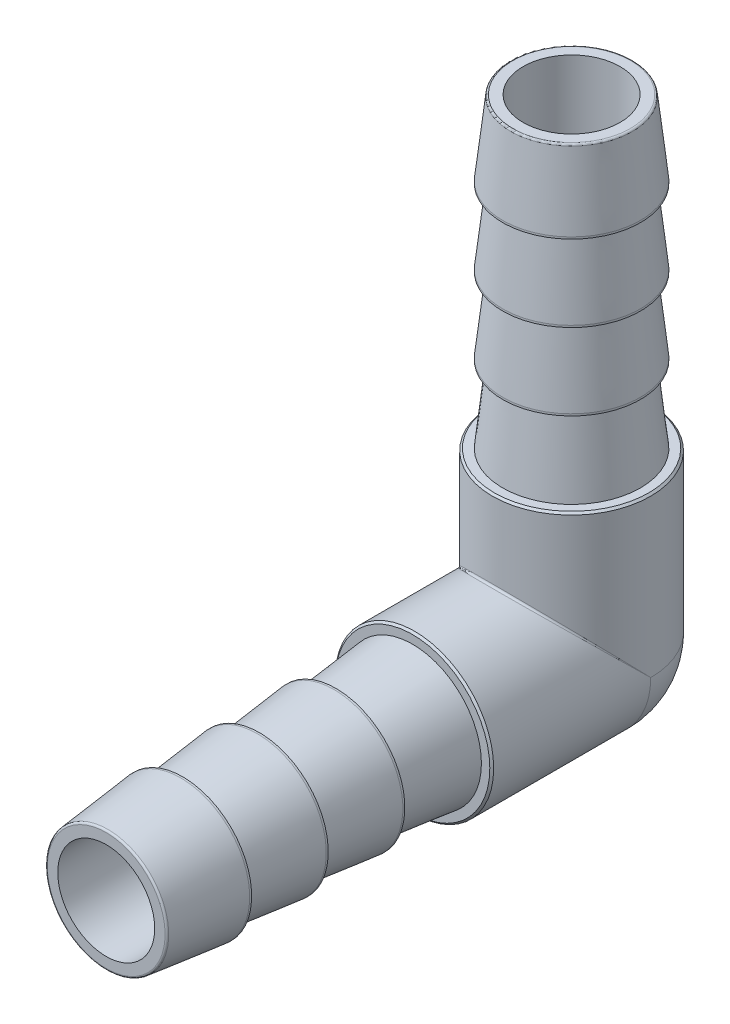
ISO-10303-21;
HEADER;
FILE_DESCRIPTION(('STEP AP214'),'2;1');
FILE_NAME('part.step','',(''),(''),'','','');
FILE_SCHEMA(('AUTOMOTIVE_DESIGN { 1 0 10303 214 1 1 1 1 }'));
ENDSEC;
DATA;
#1=APPLICATION_CONTEXT('core data for automotive mechanical design processes');
#2=APPLICATION_PROTOCOL_DEFINITION('international standard','automotive_design',2000,#1);
#3=PRODUCT_CONTEXT('',#1,'mechanical');
#4=PRODUCT('Part','Part','',(#3));
#5=PRODUCT_RELATED_PRODUCT_CATEGORY('part','',(#4));
#6=PRODUCT_DEFINITION_FORMATION('','',#4);
#7=PRODUCT_DEFINITION_CONTEXT('part definition',#1,'design');
#8=PRODUCT_DEFINITION('design','',#6,#7);
#9=PRODUCT_DEFINITION_SHAPE('','',#8);
#10=(LENGTH_UNIT() NAMED_UNIT(*) SI_UNIT(.MILLI.,.METRE.));
#11=(NAMED_UNIT(*) PLANE_ANGLE_UNIT() SI_UNIT($,.RADIAN.));
#12=(NAMED_UNIT(*) SI_UNIT($,.STERADIAN.) SOLID_ANGLE_UNIT());
#13=UNCERTAINTY_MEASURE_WITH_UNIT(LENGTH_MEASURE(1.E-05),#10,'distance_accuracy_value','');
#14=(GEOMETRIC_REPRESENTATION_CONTEXT(3) GLOBAL_UNCERTAINTY_ASSIGNED_CONTEXT((#13)) GLOBAL_UNIT_ASSIGNED_CONTEXT((#10,
#11,#12)) REPRESENTATION_CONTEXT('',''));
#15=CARTESIAN_POINT('',(0.,0.,0.));
#16=DIRECTION('',(0.,0.,1.));
#17=DIRECTION('',(1.,0.,0.));
#18=AXIS2_PLACEMENT_3D('',#15,#16,#17);
#19=CARTESIAN_POINT('',(0.,30.48,-1.06420351207939E-13));
#20=DIRECTION('',(0.,-1.,0.));
#21=DIRECTION('',(-1.,0.,0.));
#22=AXIS2_PLACEMENT_3D('',#19,#20,#21);
#23=PLANE('',#22);
#24=CARTESIAN_POINT('',(0.,30.48,-1.06420351207939E-13));
#25=DIRECTION('',(0.,-1.,0.));
#26=DIRECTION('',(0.,0.,-1.));
#27=AXIS2_PLACEMENT_3D('',#24,#25,#26);
#28=CIRCLE('',#27,3.85499802113188);
#29=CARTESIAN_POINT('',(0.,30.48,-3.85499802113199));
#30=VERTEX_POINT('',#29);
#31=EDGE_CURVE('E200',#30,#30,#28,.F.);
#32=ORIENTED_EDGE('',*,*,#31,.T.);
#33=EDGE_LOOP('',(#32));
#34=FACE_BOUND('',#33,.T.);
#35=CARTESIAN_POINT('',(0.,30.48,-1.06420351207939E-13));
#36=DIRECTION('',(0.,1.,0.));
#37=DIRECTION('',(1.,0.,0.));
#38=AXIS2_PLACEMENT_3D('',#35,#36,#37);
#39=CIRCLE('',#38,3.175);
#40=CARTESIAN_POINT('',(3.175,30.48,-1.06420351207939E-13));
#41=VERTEX_POINT('',#40);
#42=EDGE_CURVE('E85',#41,#41,#39,.T.);
#43=ORIENTED_EDGE('',*,*,#42,.F.);
#44=EDGE_LOOP('',(#43));
#45=FACE_BOUND('',#44,.T.);
#46=ADVANCED_FACE('F41',(#34,#45),#23,.F.);
#47=CARTESIAN_POINT('',(0.,0.,30.48));
#48=DIRECTION('',(0.,0.,1.));
#49=DIRECTION('',(1.,0.,0.));
#50=AXIS2_PLACEMENT_3D('',#47,#48,#49);
#51=CYLINDRICAL_SURFACE('',#50,3.175);
#52=CARTESIAN_POINT('',(0.,0.,30.48));
#53=DIRECTION('',(0.,0.,1.));
#54=DIRECTION('',(1.,0.,0.));
#55=AXIS2_PLACEMENT_3D('',#52,#53,#54);
#56=CIRCLE('',#55,3.175);
#57=CARTESIAN_POINT('',(3.175,0.,30.48));
#58=VERTEX_POINT('',#57);
#59=EDGE_CURVE('E84',#58,#58,#56,.T.);
#60=ORIENTED_EDGE('',*,*,#59,.T.);
#61=EDGE_LOOP('',(#60));
#62=FACE_BOUND('',#61,.T.);
#63=CARTESIAN_POINT('',(0.,0.,0.));
#64=DIRECTION('',(0.,0.,1.));
#65=DIRECTION('',(1.,0.,0.));
#66=AXIS2_PLACEMENT_3D('',#63,#64,#65);
#67=CIRCLE('',#66,3.175);
#68=CARTESIAN_POINT('',(-3.175,0.,0.));
#69=VERTEX_POINT('',#68);
#70=CARTESIAN_POINT('',(3.175,0.,0.));
#71=VERTEX_POINT('',#70);
#72=EDGE_CURVE('E82',#69,#71,#67,.T.);
#73=ORIENTED_EDGE('',*,*,#72,.F.);
#74=CARTESIAN_POINT('',(0.,0.,0.));
#75=DIRECTION('',(0.,-0.707106781186546,0.707106781186549));
#76=DIRECTION('',(0.,0.707106781186549,0.707106781186546));
#77=AXIS2_PLACEMENT_3D('',#74,#75,#76);
#78=ELLIPSE('',#77,4.49012806053457,3.175);
#79=EDGE_CURVE('E71',#69,#71,#78,.F.);
#80=ORIENTED_EDGE('',*,*,#79,.T.);
#81=EDGE_LOOP('',(#73,#80));
#82=FACE_BOUND('',#81,.T.);
#83=ADVANCED_FACE('F87',(#62,#82),#51,.F.);
#84=CARTESIAN_POINT('',(0.,0.,30.48));
#85=DIRECTION('',(0.,0.,-1.));
#86=DIRECTION('',(-1.,0.,0.));
#87=AXIS2_PLACEMENT_3D('',#84,#85,#86);
#88=PLANE('',#87);
#89=CARTESIAN_POINT('',(0.,0.,30.48));
#90=DIRECTION('',(0.,0.,-1.));
#91=DIRECTION('',(-1.,0.,0.));
#92=AXIS2_PLACEMENT_3D('',#89,#90,#91);
#93=CIRCLE('',#92,3.85499802113188);
#94=CARTESIAN_POINT('',(-3.85499802113188,0.,30.48));
#95=VERTEX_POINT('',#94);
#96=EDGE_CURVE('E208',#95,#95,#93,.F.);
#97=ORIENTED_EDGE('',*,*,#96,.T.);
#98=EDGE_LOOP('',(#97));
#99=FACE_BOUND('',#98,.T.);
#100=ORIENTED_EDGE('',*,*,#59,.F.);
#101=EDGE_LOOP('',(#100));
#102=FACE_BOUND('',#101,.T.);
#103=ADVANCED_FACE('F245',(#99,#102),#88,.F.);
#104=CARTESIAN_POINT('',(0.,30.48,-1.06420351207939E-13));
#105=DIRECTION('',(0.,1.,0.));
#106=DIRECTION('',(1.,0.,0.));
#107=AXIS2_PLACEMENT_3D('',#104,#105,#106);
#108=CYLINDRICAL_SURFACE('',#107,5.184775);
#109=CARTESIAN_POINT('',(0.,10.287,0.));
#110=DIRECTION('',(0.,1.,0.));
#111=DIRECTION('',(0.,0.,1.));
#112=AXIS2_PLACEMENT_3D('',#109,#110,#111);
#113=CIRCLE('',#112,5.184775);
#114=CARTESIAN_POINT('',(0.,10.287,5.18477499999996));
#115=VERTEX_POINT('',#114);
#116=EDGE_CURVE('E78',#115,#115,#113,.F.);
#117=ORIENTED_EDGE('',*,*,#116,.T.);
#118=EDGE_LOOP('',(#117));
#119=FACE_BOUND('',#118,.T.);
#120=CARTESIAN_POINT('',(0.,0.,0.));
#121=DIRECTION('',(0.,1.,0.));
#122=DIRECTION('',(1.,0.,0.));
#123=AXIS2_PLACEMENT_3D('',#120,#121,#122);
#124=CIRCLE('',#123,5.184775);
#125=CARTESIAN_POINT('',(5.184775,0.,0.));
#126=VERTEX_POINT('',#125);
#127=CARTESIAN_POINT('',(-5.184775,0.,0.));
#128=VERTEX_POINT('',#127);
#129=EDGE_CURVE('E135',#126,#128,#124,.T.);
#130=ORIENTED_EDGE('',*,*,#129,.T.);
#131=CARTESIAN_POINT('',(0.,0.,0.));
#132=DIRECTION('',(0.,-0.698500220046649,0.71560983964363));
#133=DIRECTION('',(0.,0.71560983964363,0.698500220046649));
#134=AXIS2_PLACEMENT_3D('',#131,#132,#133);
#135=ELLIPSE('',#134,7.4227249343654,5.184775);
#136=EDGE_CURVE('E55',#128,#126,#135,.F.);
#137=ORIENTED_EDGE('',*,*,#136,.T.);
#138=EDGE_LOOP('',(#130,#137));
#139=FACE_BOUND('',#138,.T.);
#140=ADVANCED_FACE('F217',(#119,#139),#108,.T.);
#141=CARTESIAN_POINT('',(0.,0.,30.48));
#142=DIRECTION('',(0.,0.,1.));
#143=DIRECTION('',(1.,0.,0.));
#144=AXIS2_PLACEMENT_3D('',#141,#142,#143);
#145=CYLINDRICAL_SURFACE('',#144,5.184775);
#146=CARTESIAN_POINT('',(0.,0.,10.287));
#147=DIRECTION('',(0.,0.,1.));
#148=DIRECTION('',(1.,0.,0.));
#149=AXIS2_PLACEMENT_3D('',#146,#147,#148);
#150=CIRCLE('',#149,5.184775);
#151=CARTESIAN_POINT('',(5.184775,0.,10.287));
#152=VERTEX_POINT('',#151);
#153=EDGE_CURVE('E186',#152,#152,#150,.F.);
#154=ORIENTED_EDGE('',*,*,#153,.T.);
#155=EDGE_LOOP('',(#154));
#156=FACE_BOUND('',#155,.T.);
#157=CARTESIAN_POINT('',(0.,0.,0.));
#158=DIRECTION('',(0.,0.,1.));
#159=DIRECTION('',(1.,0.,0.));
#160=AXIS2_PLACEMENT_3D('',#157,#158,#159);
#161=CIRCLE('',#160,5.184775);
#162=EDGE_CURVE('E179',#128,#126,#161,.T.);
#163=ORIENTED_EDGE('',*,*,#162,.T.);
#164=CARTESIAN_POINT('',(0.,0.,0.));
#165=DIRECTION('',(0.,-0.715609839643628,0.698500220046652));
#166=DIRECTION('',(0.,0.698500220046652,0.715609839643628));
#167=AXIS2_PLACEMENT_3D('',#164,#165,#166);
#168=ELLIPSE('',#167,7.4227249343654,5.184775);
#169=EDGE_CURVE('E11',#126,#128,#168,.T.);
#170=ORIENTED_EDGE('',*,*,#169,.T.);
#171=EDGE_LOOP('',(#163,#170));
#172=FACE_BOUND('',#171,.T.);
#173=ADVANCED_FACE('F220',(#156,#172),#145,.T.);
#174=CARTESIAN_POINT('',(0.,0.,20.574));
#175=DIRECTION('',(0.,0.,-1.));
#176=DIRECTION('',(-1.,0.,0.));
#177=AXIS2_PLACEMENT_3D('',#174,#175,#176);
#178=CONICAL_SURFACE('',#177,4.5085,0.109944462919684);
#179=CARTESIAN_POINT('',(0.,0.,25.4635));
#180=DIRECTION('',(0.,0.,-1.));
#181=DIRECTION('',(-1.,0.,0.));
#182=AXIS2_PLACEMENT_3D('',#179,#180,#181);
#183=CIRCLE('',#182,3.96875);
#184=CARTESIAN_POINT('',(-3.96875,0.,25.4635));
#185=VERTEX_POINT('',#184);
#186=EDGE_CURVE('E151',#185,#185,#183,.T.);
#187=ORIENTED_EDGE('',*,*,#186,.T.);
#188=EDGE_LOOP('',(#187));
#189=FACE_BOUND('',#188,.T.);
#190=CARTESIAN_POINT('',(0.,0.,20.574));
#191=DIRECTION('',(0.,0.,-1.));
#192=DIRECTION('',(-1.,0.,0.));
#193=AXIS2_PLACEMENT_3D('',#190,#191,#192);
#194=CIRCLE('',#193,4.5085);
#195=CARTESIAN_POINT('',(-4.5085,0.,20.574));
#196=VERTEX_POINT('',#195);
#197=EDGE_CURVE('E159',#196,#196,#194,.T.);
#198=ORIENTED_EDGE('',*,*,#197,.F.);
#199=EDGE_LOOP('',(#198));
#200=FACE_BOUND('',#199,.T.);
#201=ADVANCED_FACE('F272',(#189,#200),#178,.T.);
#202=CARTESIAN_POINT('',(0.,0.,5.3975));
#203=DIRECTION('',(0.,0.,-1.));
#204=DIRECTION('',(-1.,0.,0.));
#205=AXIS2_PLACEMENT_3D('',#202,#203,#204);
#206=CYLINDRICAL_SURFACE('',#205,4.5085);
#207=ORIENTED_EDGE('',*,*,#197,.T.);
#208=EDGE_LOOP('',(#207));
#209=FACE_BOUND('',#208,.T.);
#210=CARTESIAN_POINT('',(0.,0.,20.447));
#211=DIRECTION('',(0.,0.,-1.));
#212=DIRECTION('',(-1.,0.,0.));
#213=AXIS2_PLACEMENT_3D('',#210,#211,#212);
#214=CIRCLE('',#213,4.5085);
#215=CARTESIAN_POINT('',(-4.5085,0.,20.447));
#216=VERTEX_POINT('',#215);
#217=EDGE_CURVE('E155',#216,#216,#214,.T.);
#218=ORIENTED_EDGE('',*,*,#217,.F.);
#219=EDGE_LOOP('',(#218));
#220=FACE_BOUND('',#219,.T.);
#221=ADVANCED_FACE('F268',(#209,#220),#206,.T.);
#222=CARTESIAN_POINT('',(0.,3.96875,20.447));
#223=DIRECTION('',(0.,0.,-1.));
#224=DIRECTION('',(-1.,0.,0.));
#225=AXIS2_PLACEMENT_3D('',#222,#223,#224);
#226=PLANE('',#225);
#227=ORIENTED_EDGE('',*,*,#217,.T.);
#228=EDGE_LOOP('',(#227));
#229=FACE_BOUND('',#228,.T.);
#230=CARTESIAN_POINT('',(0.,0.,20.447));
#231=DIRECTION('',(0.,0.,-1.));
#232=DIRECTION('',(-1.,0.,0.));
#233=AXIS2_PLACEMENT_3D('',#230,#231,#232);
#234=CIRCLE('',#233,3.96875);
#235=CARTESIAN_POINT('',(-3.96875,0.,20.447));
#236=VERTEX_POINT('',#235);
#237=EDGE_CURVE('E139',#236,#236,#234,.T.);
#238=ORIENTED_EDGE('',*,*,#237,.F.);
#239=EDGE_LOOP('',(#238));
#240=FACE_BOUND('',#239,.T.);
#241=ADVANCED_FACE('F264',(#229,#240),#226,.T.);
#242=CARTESIAN_POINT('',(0.,0.,25.5905));
#243=DIRECTION('',(0.,0.,-1.));
#244=DIRECTION('',(-1.,0.,0.));
#245=AXIS2_PLACEMENT_3D('',#242,#243,#244);
#246=CONICAL_SURFACE('',#245,4.5085,0.109944462919684);
#247=CARTESIAN_POINT('',(0.,0.,30.3669348336045));
#248=DIRECTION('',(0.,0.,-1.));
#249=DIRECTION('',(-1.,0.,0.));
#250=AXIS2_PLACEMENT_3D('',#247,#248,#249);
#251=CIRCLE('',#250,3.98123121966703);
#252=CARTESIAN_POINT('',(-3.98123121966703,0.,30.3669348336045));
#253=VERTEX_POINT('',#252);
#254=EDGE_CURVE('E204',#253,#253,#251,.T.);
#255=ORIENTED_EDGE('',*,*,#254,.T.);
#256=EDGE_LOOP('',(#255));
#257=FACE_BOUND('',#256,.T.);
#258=CARTESIAN_POINT('',(0.,0.,25.5905));
#259=DIRECTION('',(0.,0.,-1.));
#260=DIRECTION('',(-1.,0.,0.));
#261=AXIS2_PLACEMENT_3D('',#258,#259,#260);
#262=CIRCLE('',#261,4.5085);
#263=CARTESIAN_POINT('',(-4.5085,0.,25.5905));
#264=VERTEX_POINT('',#263);
#265=EDGE_CURVE('E167',#264,#264,#262,.T.);
#266=ORIENTED_EDGE('',*,*,#265,.F.);
#267=EDGE_LOOP('',(#266));
#268=FACE_BOUND('',#267,.T.);
#269=ADVANCED_FACE('F267',(#257,#268),#246,.T.);
#270=CARTESIAN_POINT('',(0.,0.,10.414));
#271=DIRECTION('',(0.,0.,-1.));
#272=DIRECTION('',(-1.,0.,0.));
#273=AXIS2_PLACEMENT_3D('',#270,#271,#272);
#274=CYLINDRICAL_SURFACE('',#273,4.5085);
#275=ORIENTED_EDGE('',*,*,#265,.T.);
#276=EDGE_LOOP('',(#275));
#277=FACE_BOUND('',#276,.T.);
#278=CARTESIAN_POINT('',(0.,0.,25.4635));
#279=DIRECTION('',(0.,0.,-1.));
#280=DIRECTION('',(-1.,0.,0.));
#281=AXIS2_PLACEMENT_3D('',#278,#279,#280);
#282=CIRCLE('',#281,4.5085);
#283=CARTESIAN_POINT('',(-4.5085,0.,25.4635));
#284=VERTEX_POINT('',#283);
#285=EDGE_CURVE('E163',#284,#284,#282,.T.);
#286=ORIENTED_EDGE('',*,*,#285,.F.);
#287=EDGE_LOOP('',(#286));
#288=FACE_BOUND('',#287,.T.);
#289=ADVANCED_FACE('F279',(#277,#288),#274,.T.);
#290=CARTESIAN_POINT('',(0.,3.96875,25.4635));
#291=DIRECTION('',(0.,0.,-1.));
#292=DIRECTION('',(-1.,0.,0.));
#293=AXIS2_PLACEMENT_3D('',#290,#291,#292);
#294=PLANE('',#293);
#295=ORIENTED_EDGE('',*,*,#285,.T.);
#296=EDGE_LOOP('',(#295));
#297=FACE_BOUND('',#296,.T.);
#298=ORIENTED_EDGE('',*,*,#186,.F.);
#299=EDGE_LOOP('',(#298));
#300=FACE_BOUND('',#299,.T.);
#301=ADVANCED_FACE('F262',(#297,#300),#294,.T.);
#302=CARTESIAN_POINT('',(0.,0.,15.5575));
#303=DIRECTION('',(0.,0.,-1.));
#304=DIRECTION('',(-1.,0.,0.));
#305=AXIS2_PLACEMENT_3D('',#302,#303,#304);
#306=CONICAL_SURFACE('',#305,4.5085,0.109944462919684);
#307=ORIENTED_EDGE('',*,*,#237,.T.);
#308=EDGE_LOOP('',(#307));
#309=FACE_BOUND('',#308,.T.);
#310=CARTESIAN_POINT('',(0.,0.,15.5575));
#311=DIRECTION('',(0.,0.,-1.));
#312=DIRECTION('',(-1.,0.,0.));
#313=AXIS2_PLACEMENT_3D('',#310,#311,#312);
#314=CIRCLE('',#313,4.5085);
#315=CARTESIAN_POINT('',(-4.5085,0.,15.5575));
#316=VERTEX_POINT('',#315);
#317=EDGE_CURVE('E147',#316,#316,#314,.T.);
#318=ORIENTED_EDGE('',*,*,#317,.F.);
#319=EDGE_LOOP('',(#318));
#320=FACE_BOUND('',#319,.T.);
#321=ADVANCED_FACE('F258',(#309,#320),#306,.T.);
#322=CARTESIAN_POINT('',(0.,0.,0.380999999999996));
#323=DIRECTION('',(0.,0.,-1.));
#324=DIRECTION('',(-1.,0.,0.));
#325=AXIS2_PLACEMENT_3D('',#322,#323,#324);
#326=CYLINDRICAL_SURFACE('',#325,4.5085);
#327=ORIENTED_EDGE('',*,*,#317,.T.);
#328=EDGE_LOOP('',(#327));
#329=FACE_BOUND('',#328,.T.);
#330=CARTESIAN_POINT('',(0.,0.,15.4305));
#331=DIRECTION('',(0.,0.,-1.));
#332=DIRECTION('',(-1.,0.,0.));
#333=AXIS2_PLACEMENT_3D('',#330,#331,#332);
#334=CIRCLE('',#333,4.5085);
#335=CARTESIAN_POINT('',(-4.5085,0.,15.4305));
#336=VERTEX_POINT('',#335);
#337=EDGE_CURVE('E143',#336,#336,#334,.T.);
#338=ORIENTED_EDGE('',*,*,#337,.F.);
#339=EDGE_LOOP('',(#338));
#340=FACE_BOUND('',#339,.T.);
#341=ADVANCED_FACE('F234',(#329,#340),#326,.T.);
#342=CARTESIAN_POINT('',(0.,3.96875,15.4305));
#343=DIRECTION('',(0.,0.,-1.));
#344=DIRECTION('',(-1.,0.,0.));
#345=AXIS2_PLACEMENT_3D('',#342,#343,#344);
#346=PLANE('',#345);
#347=ORIENTED_EDGE('',*,*,#337,.T.);
#348=EDGE_LOOP('',(#347));
#349=FACE_BOUND('',#348,.T.);
#350=CARTESIAN_POINT('',(0.,0.,15.4305));
#351=DIRECTION('',(0.,0.,1.));
#352=DIRECTION('',(1.,0.,0.));
#353=AXIS2_PLACEMENT_3D('',#350,#351,#352);
#354=CIRCLE('',#353,3.96875);
#355=CARTESIAN_POINT('',(3.96875,0.,15.4305));
#356=VERTEX_POINT('',#355);
#357=EDGE_CURVE('E175',#356,#356,#354,.T.);
#358=ORIENTED_EDGE('',*,*,#357,.T.);
#359=EDGE_LOOP('',(#358));
#360=FACE_BOUND('',#359,.T.);
#361=ADVANCED_FACE('F225',(#349,#360),#346,.T.);
#362=CARTESIAN_POINT('',(0.,0.,0.));
#363=DIRECTION('',(0.,0.,1.));
#364=DIRECTION('',(0.,1.,0.));
#365=AXIS2_PLACEMENT_3D('',#362,#363,#364);
#366=SPHERICAL_SURFACE('',#365,5.184775);
#367=ORIENTED_EDGE('',*,*,#162,.F.);
#368=ORIENTED_EDGE('',*,*,#129,.F.);
#369=EDGE_LOOP('',(#367,#368));
#370=FACE_BOUND('',#369,.T.);
#371=ADVANCED_FACE('F222',(#370),#366,.T.);
#372=CARTESIAN_POINT('',(0.,4.5085,10.414));
#373=DIRECTION('',(0.,0.,1.));
#374=DIRECTION('',(1.,0.,0.));
#375=AXIS2_PLACEMENT_3D('',#372,#373,#374);
#376=PLANE('',#375);
#377=CARTESIAN_POINT('',(0.,0.,10.414));
#378=DIRECTION('',(0.,0.,1.));
#379=DIRECTION('',(1.,0.,0.));
#380=AXIS2_PLACEMENT_3D('',#377,#378,#379);
#381=CIRCLE('',#380,5.05777499999999);
#382=CARTESIAN_POINT('',(5.05777499999999,0.,10.414));
#383=VERTEX_POINT('',#382);
#384=EDGE_CURVE('E182',#383,#383,#381,.T.);
#385=ORIENTED_EDGE('',*,*,#384,.T.);
#386=EDGE_LOOP('',(#385));
#387=FACE_BOUND('',#386,.T.);
#388=CARTESIAN_POINT('',(0.,0.,10.414));
#389=DIRECTION('',(0.,0.,1.));
#390=DIRECTION('',(1.,0.,0.));
#391=AXIS2_PLACEMENT_3D('',#388,#389,#390);
#392=CIRCLE('',#391,4.5085);
#393=CARTESIAN_POINT('',(4.5085,0.,10.414));
#394=VERTEX_POINT('',#393);
#395=EDGE_CURVE('E171',#394,#394,#392,.T.);
#396=ORIENTED_EDGE('',*,*,#395,.F.);
#397=EDGE_LOOP('',(#396));
#398=FACE_BOUND('',#397,.T.);
#399=ADVANCED_FACE('F224',(#387,#398),#376,.T.);
#400=CARTESIAN_POINT('',(0.,0.,15.4305));
#401=DIRECTION('',(0.,0.,-1.));
#402=DIRECTION('',(-1.,0.,0.));
#403=AXIS2_PLACEMENT_3D('',#400,#401,#402);
#404=CONICAL_SURFACE('',#403,3.96875,0.10718259999368);
#405=ORIENTED_EDGE('',*,*,#395,.T.);
#406=EDGE_LOOP('',(#405));
#407=FACE_BOUND('',#406,.T.);
#408=ORIENTED_EDGE('',*,*,#357,.F.);
#409=EDGE_LOOP('',(#408));
#410=FACE_BOUND('',#409,.T.);
#411=ADVANCED_FACE('F231',(#407,#410),#404,.T.);
#412=CARTESIAN_POINT('',(0.,0.,10.414));
#413=DIRECTION('',(0.,0.,-1.));
#414=DIRECTION('',(-1.,0.,0.));
#415=AXIS2_PLACEMENT_3D('',#412,#413,#414);
#416=CONICAL_SURFACE('',#415,5.05777499999999,0.785398163397452);
#417=ORIENTED_EDGE('',*,*,#153,.F.);
#418=EDGE_LOOP('',(#417));
#419=FACE_BOUND('',#418,.T.);
#420=ORIENTED_EDGE('',*,*,#384,.F.);
#421=EDGE_LOOP('',(#420));
#422=FACE_BOUND('',#421,.T.);
#423=ADVANCED_FACE('F287',(#419,#422),#416,.T.);
#424=CARTESIAN_POINT('',(0.,15.4305,0.));
#425=DIRECTION('',(0.,-1.,0.));
#426=DIRECTION('',(-1.,0.,0.));
#427=AXIS2_PLACEMENT_3D('',#424,#425,#426);
#428=CONICAL_SURFACE('',#427,3.96875,0.10718259999368);
#429=CARTESIAN_POINT('',(0.,10.414,0.));
#430=DIRECTION('',(0.,1.,0.));
#431=DIRECTION('',(1.,0.,0.));
#432=AXIS2_PLACEMENT_3D('',#429,#430,#431);
#433=CIRCLE('',#432,4.5085);
#434=CARTESIAN_POINT('',(4.5085,10.414,0.));
#435=VERTEX_POINT('',#434);
#436=EDGE_CURVE('E127',#435,#435,#433,.T.);
#437=ORIENTED_EDGE('',*,*,#436,.T.);
#438=EDGE_LOOP('',(#437));
#439=FACE_BOUND('',#438,.T.);
#440=CARTESIAN_POINT('',(0.,15.4305,0.));
#441=DIRECTION('',(0.,1.,0.));
#442=DIRECTION('',(1.,0.,0.));
#443=AXIS2_PLACEMENT_3D('',#440,#441,#442);
#444=CIRCLE('',#443,3.96875);
#445=CARTESIAN_POINT('',(3.96875,15.4305,0.));
#446=VERTEX_POINT('',#445);
#447=EDGE_CURVE('E131',#446,#446,#444,.T.);
#448=ORIENTED_EDGE('',*,*,#447,.F.);
#449=EDGE_LOOP('',(#448));
#450=FACE_BOUND('',#449,.T.);
#451=ADVANCED_FACE('F250',(#439,#450),#428,.T.);
#452=CARTESIAN_POINT('',(0.,10.414,-4.50850000000004));
#453=DIRECTION('',(0.,1.,0.));
#454=DIRECTION('',(1.,0.,0.));
#455=AXIS2_PLACEMENT_3D('',#452,#453,#454);
#456=PLANE('',#455);
#457=CARTESIAN_POINT('',(0.,10.414,0.));
#458=DIRECTION('',(0.,1.,0.));
#459=DIRECTION('',(0.,0.,1.));
#460=AXIS2_PLACEMENT_3D('',#457,#458,#459);
#461=CIRCLE('',#460,5.05777500000001);
#462=CARTESIAN_POINT('',(0.,10.414,5.05777499999998));
#463=VERTEX_POINT('',#462);
#464=EDGE_CURVE('E190',#463,#463,#461,.T.);
#465=ORIENTED_EDGE('',*,*,#464,.T.);
#466=EDGE_LOOP('',(#465));
#467=FACE_BOUND('',#466,.T.);
#468=ORIENTED_EDGE('',*,*,#436,.F.);
#469=EDGE_LOOP('',(#468));
#470=FACE_BOUND('',#469,.T.);
#471=ADVANCED_FACE('F302',(#467,#470),#456,.T.);
#472=CARTESIAN_POINT('',(0.,15.5575,0.));
#473=DIRECTION('',(0.,-1.,0.));
#474=DIRECTION('',(-1.,0.,0.));
#475=AXIS2_PLACEMENT_3D('',#472,#473,#474);
#476=CONICAL_SURFACE('',#475,4.5085,0.109944462919684);
#477=CARTESIAN_POINT('',(0.,20.447,0.));
#478=DIRECTION('',(0.,-1.,0.));
#479=DIRECTION('',(-1.,0.,0.));
#480=AXIS2_PLACEMENT_3D('',#477,#478,#479);
#481=CIRCLE('',#480,3.96875);
#482=CARTESIAN_POINT('',(-3.96875,20.447,0.));
#483=VERTEX_POINT('',#482);
#484=EDGE_CURVE('E89',#483,#483,#481,.T.);
#485=ORIENTED_EDGE('',*,*,#484,.T.);
#486=EDGE_LOOP('',(#485));
#487=FACE_BOUND('',#486,.T.);
#488=CARTESIAN_POINT('',(0.,15.5575,0.));
#489=DIRECTION('',(0.,-1.,0.));
#490=DIRECTION('',(-1.,0.,0.));
#491=AXIS2_PLACEMENT_3D('',#488,#489,#490);
#492=CIRCLE('',#491,4.5085);
#493=CARTESIAN_POINT('',(-4.5085,15.5575,0.));
#494=VERTEX_POINT('',#493);
#495=EDGE_CURVE('E103',#494,#494,#492,.T.);
#496=ORIENTED_EDGE('',*,*,#495,.F.);
#497=EDGE_LOOP('',(#496));
#498=FACE_BOUND('',#497,.T.);
#499=ADVANCED_FACE('F421',(#487,#498),#476,.T.);
#500=CARTESIAN_POINT('',(0.,0.380999999999996,0.));
#501=DIRECTION('',(0.,-1.,0.));
#502=DIRECTION('',(-1.,0.,0.));
#503=AXIS2_PLACEMENT_3D('',#500,#501,#502);
#504=CYLINDRICAL_SURFACE('',#503,4.5085);
#505=ORIENTED_EDGE('',*,*,#495,.T.);
#506=EDGE_LOOP('',(#505));
#507=FACE_BOUND('',#506,.T.);
#508=CARTESIAN_POINT('',(0.,15.4305,0.));
#509=DIRECTION('',(0.,-1.,0.));
#510=DIRECTION('',(-1.,0.,0.));
#511=AXIS2_PLACEMENT_3D('',#508,#509,#510);
#512=CIRCLE('',#511,4.5085);
#513=CARTESIAN_POINT('',(-4.5085,15.4305,0.));
#514=VERTEX_POINT('',#513);
#515=EDGE_CURVE('E95',#514,#514,#512,.T.);
#516=ORIENTED_EDGE('',*,*,#515,.F.);
#517=EDGE_LOOP('',(#516));
#518=FACE_BOUND('',#517,.T.);
#519=ADVANCED_FACE('F431',(#507,#518),#504,.T.);
#520=CARTESIAN_POINT('',(0.,15.4305,-3.96875000000005));
#521=DIRECTION('',(0.,-1.,0.));
#522=DIRECTION('',(-1.,0.,0.));
#523=AXIS2_PLACEMENT_3D('',#520,#521,#522);
#524=PLANE('',#523);
#525=ORIENTED_EDGE('',*,*,#515,.T.);
#526=EDGE_LOOP('',(#525));
#527=FACE_BOUND('',#526,.T.);
#528=ORIENTED_EDGE('',*,*,#447,.T.);
#529=EDGE_LOOP('',(#528));
#530=FACE_BOUND('',#529,.T.);
#531=ADVANCED_FACE('F442',(#527,#530),#524,.T.);
#532=CARTESIAN_POINT('',(0.,25.5905,0.));
#533=DIRECTION('',(0.,-1.,0.));
#534=DIRECTION('',(-1.,0.,0.));
#535=AXIS2_PLACEMENT_3D('',#532,#533,#534);
#536=CONICAL_SURFACE('',#535,4.5085,0.109944462919684);
#537=CARTESIAN_POINT('',(0.,30.3669348336045,-1.06025586289396E-13));
#538=DIRECTION('',(0.,-1.,0.));
#539=DIRECTION('',(0.,0.,-1.));
#540=AXIS2_PLACEMENT_3D('',#537,#538,#539);
#541=CIRCLE('',#540,3.98123121966703);
#542=CARTESIAN_POINT('',(0.,30.3669348336045,-3.98123121966714));
#543=VERTEX_POINT('',#542);
#544=EDGE_CURVE('E77',#543,#543,#541,.T.);
#545=ORIENTED_EDGE('',*,*,#544,.T.);
#546=EDGE_LOOP('',(#545));
#547=FACE_BOUND('',#546,.T.);
#548=CARTESIAN_POINT('',(0.,25.5905,0.));
#549=DIRECTION('',(0.,-1.,0.));
#550=DIRECTION('',(-1.,0.,0.));
#551=AXIS2_PLACEMENT_3D('',#548,#549,#550);
#552=CIRCLE('',#551,4.5085);
#553=CARTESIAN_POINT('',(-4.5085,25.5905,0.));
#554=VERTEX_POINT('',#553);
#555=EDGE_CURVE('E123',#554,#554,#552,.T.);
#556=ORIENTED_EDGE('',*,*,#555,.F.);
#557=EDGE_LOOP('',(#556));
#558=FACE_BOUND('',#557,.T.);
#559=ADVANCED_FACE('F452',(#547,#558),#536,.T.);
#560=CARTESIAN_POINT('',(0.,10.414,0.));
#561=DIRECTION('',(0.,-1.,0.));
#562=DIRECTION('',(-1.,0.,0.));
#563=AXIS2_PLACEMENT_3D('',#560,#561,#562);
#564=CYLINDRICAL_SURFACE('',#563,4.5085);
#565=ORIENTED_EDGE('',*,*,#555,.T.);
#566=EDGE_LOOP('',(#565));
#567=FACE_BOUND('',#566,.T.);
#568=CARTESIAN_POINT('',(0.,25.4635,0.));
#569=DIRECTION('',(0.,-1.,0.));
#570=DIRECTION('',(-1.,0.,0.));
#571=AXIS2_PLACEMENT_3D('',#568,#569,#570);
#572=CIRCLE('',#571,4.5085);
#573=CARTESIAN_POINT('',(-4.5085,25.4635,0.));
#574=VERTEX_POINT('',#573);
#575=EDGE_CURVE('E119',#574,#574,#572,.T.);
#576=ORIENTED_EDGE('',*,*,#575,.F.);
#577=EDGE_LOOP('',(#576));
#578=FACE_BOUND('',#577,.T.);
#579=ADVANCED_FACE('F460',(#567,#578),#564,.T.);
#580=CARTESIAN_POINT('',(0.,25.4635,-3.96875000000009));
#581=DIRECTION('',(0.,-1.,0.));
#582=DIRECTION('',(-1.,0.,0.));
#583=AXIS2_PLACEMENT_3D('',#580,#581,#582);
#584=PLANE('',#583);
#585=ORIENTED_EDGE('',*,*,#575,.T.);
#586=EDGE_LOOP('',(#585));
#587=FACE_BOUND('',#586,.T.);
#588=CARTESIAN_POINT('',(0.,25.4635,0.));
#589=DIRECTION('',(0.,-1.,0.));
#590=DIRECTION('',(-1.,0.,0.));
#591=AXIS2_PLACEMENT_3D('',#588,#589,#590);
#592=CIRCLE('',#591,3.96875);
#593=CARTESIAN_POINT('',(-3.96875,25.4635,0.));
#594=VERTEX_POINT('',#593);
#595=EDGE_CURVE('E107',#594,#594,#592,.T.);
#596=ORIENTED_EDGE('',*,*,#595,.F.);
#597=EDGE_LOOP('',(#596));
#598=FACE_BOUND('',#597,.T.);
#599=ADVANCED_FACE('F465',(#587,#598),#584,.T.);
#600=CARTESIAN_POINT('',(0.,20.574,0.));
#601=DIRECTION('',(0.,-1.,0.));
#602=DIRECTION('',(-1.,0.,0.));
#603=AXIS2_PLACEMENT_3D('',#600,#601,#602);
#604=CONICAL_SURFACE('',#603,4.5085,0.109944462919684);
#605=ORIENTED_EDGE('',*,*,#595,.T.);
#606=EDGE_LOOP('',(#605));
#607=FACE_BOUND('',#606,.T.);
#608=CARTESIAN_POINT('',(0.,20.574,0.));
#609=DIRECTION('',(0.,-1.,0.));
#610=DIRECTION('',(-1.,0.,0.));
#611=AXIS2_PLACEMENT_3D('',#608,#609,#610);
#612=CIRCLE('',#611,4.5085);
#613=CARTESIAN_POINT('',(-4.5085,20.574,0.));
#614=VERTEX_POINT('',#613);
#615=EDGE_CURVE('E115',#614,#614,#612,.T.);
#616=ORIENTED_EDGE('',*,*,#615,.F.);
#617=EDGE_LOOP('',(#616));
#618=FACE_BOUND('',#617,.T.);
#619=ADVANCED_FACE('F474',(#607,#618),#604,.T.);
#620=CARTESIAN_POINT('',(0.,5.3975,0.));
#621=DIRECTION('',(0.,-1.,0.));
#622=DIRECTION('',(-1.,0.,0.));
#623=AXIS2_PLACEMENT_3D('',#620,#621,#622);
#624=CYLINDRICAL_SURFACE('',#623,4.5085);
#625=ORIENTED_EDGE('',*,*,#615,.T.);
#626=EDGE_LOOP('',(#625));
#627=FACE_BOUND('',#626,.T.);
#628=CARTESIAN_POINT('',(0.,20.447,0.));
#629=DIRECTION('',(0.,-1.,0.));
#630=DIRECTION('',(-1.,0.,0.));
#631=AXIS2_PLACEMENT_3D('',#628,#629,#630);
#632=CIRCLE('',#631,4.5085);
#633=CARTESIAN_POINT('',(-4.5085,20.447,0.));
#634=VERTEX_POINT('',#633);
#635=EDGE_CURVE('E111',#634,#634,#632,.T.);
#636=ORIENTED_EDGE('',*,*,#635,.F.);
#637=EDGE_LOOP('',(#636));
#638=FACE_BOUND('',#637,.T.);
#639=ADVANCED_FACE('F483',(#627,#638),#624,.T.);
#640=CARTESIAN_POINT('',(0.,20.447,-3.96875000000007));
#641=DIRECTION('',(0.,-1.,0.));
#642=DIRECTION('',(-1.,0.,0.));
#643=AXIS2_PLACEMENT_3D('',#640,#641,#642);
#644=PLANE('',#643);
#645=ORIENTED_EDGE('',*,*,#635,.T.);
#646=EDGE_LOOP('',(#645));
#647=FACE_BOUND('',#646,.T.);
#648=ORIENTED_EDGE('',*,*,#484,.F.);
#649=EDGE_LOOP('',(#648));
#650=FACE_BOUND('',#649,.T.);
#651=ADVANCED_FACE('F311',(#647,#650),#644,.T.);
#652=CARTESIAN_POINT('',(0.,10.414,0.));
#653=DIRECTION('',(0.,-1.,0.));
#654=DIRECTION('',(0.,0.,-1.));
#655=AXIS2_PLACEMENT_3D('',#652,#653,#654);
#656=CONICAL_SURFACE('',#655,5.05777500000001,0.785398163397435);
#657=ORIENTED_EDGE('',*,*,#116,.F.);
#658=EDGE_LOOP('',(#657));
#659=FACE_BOUND('',#658,.T.);
#660=ORIENTED_EDGE('',*,*,#464,.F.);
#661=EDGE_LOOP('',(#660));
#662=FACE_BOUND('',#661,.T.);
#663=ADVANCED_FACE('F308',(#659,#662),#656,.T.);
#664=CARTESIAN_POINT('',(0.,0.,0.));
#665=DIRECTION('',(0.,0.,1.));
#666=DIRECTION('',(0.,1.,0.));
#667=AXIS2_PLACEMENT_3D('',#664,#665,#666);
#668=SPHERICAL_SURFACE('',#667,3.175);
#669=CARTESIAN_POINT('',(0.,0.,0.));
#670=DIRECTION('',(0.,1.,0.));
#671=DIRECTION('',(1.,0.,0.));
#672=AXIS2_PLACEMENT_3D('',#669,#670,#671);
#673=CIRCLE('',#672,3.175);
#674=EDGE_CURVE('E61',#71,#69,#673,.T.);
#675=ORIENTED_EDGE('',*,*,#674,.T.);
#676=ORIENTED_EDGE('',*,*,#72,.T.);
#677=EDGE_LOOP('',(#675,#676));
#678=FACE_BOUND('',#677,.T.);
#679=ADVANCED_FACE('F81',(#678),#668,.F.);
#680=CARTESIAN_POINT('',(0.,30.48,-1.06420351207939E-13));
#681=DIRECTION('',(0.,1.,0.));
#682=DIRECTION('',(1.,0.,0.));
#683=AXIS2_PLACEMENT_3D('',#680,#681,#682);
#684=CYLINDRICAL_SURFACE('',#683,3.175);
#685=ORIENTED_EDGE('',*,*,#42,.T.);
#686=EDGE_LOOP('',(#685));
#687=FACE_BOUND('',#686,.T.);
#688=ORIENTED_EDGE('',*,*,#674,.F.);
#689=ORIENTED_EDGE('',*,*,#79,.F.);
#690=EDGE_LOOP('',(#688,#689));
#691=FACE_BOUND('',#690,.T.);
#692=ADVANCED_FACE('F72',(#687,#691),#684,.F.);
#693=CARTESIAN_POINT('',(0.,30.353,-1.05976933077906E-13));
#694=DIRECTION('',(0.,-1.,0.));
#695=DIRECTION('',(0.,0.,-1.));
#696=AXIS2_PLACEMENT_3D('',#693,#694,#695);
#697=TOROIDAL_SURFACE('',#696,3.85499802113188,0.127);
#698=ORIENTED_EDGE('',*,*,#31,.F.);
#699=EDGE_LOOP('',(#698));
#700=FACE_BOUND('',#699,.T.);
#701=ORIENTED_EDGE('',*,*,#544,.F.);
#702=EDGE_LOOP('',(#701));
#703=FACE_BOUND('',#702,.T.);
#704=ADVANCED_FACE('F313',(#700,#703),#697,.T.);
#705=CARTESIAN_POINT('',(0.,0.,30.353));
#706=DIRECTION('',(0.,0.,-1.));
#707=DIRECTION('',(-1.,0.,0.));
#708=AXIS2_PLACEMENT_3D('',#705,#706,#707);
#709=TOROIDAL_SURFACE('',#708,3.85499802113188,0.127);
#710=ORIENTED_EDGE('',*,*,#96,.F.);
#711=EDGE_LOOP('',(#710));
#712=FACE_BOUND('',#711,.T.);
#713=ORIENTED_EDGE('',*,*,#254,.F.);
#714=EDGE_LOOP('',(#713));
#715=FACE_BOUND('',#714,.T.);
#716=ADVANCED_FACE('F315',(#712,#715),#709,.T.);
#717=CARTESIAN_POINT('',(-5.184775,0.,0.));
#718=CARTESIAN_POINT('',(-5.184775,0.,0.));
#719=CARTESIAN_POINT('',(-5.184775,0.,0.));
#720=CARTESIAN_POINT('',(-5.18468412320805,0.231406134547263,0.22587341166508));
#721=CARTESIAN_POINT('',(-5.18496827930225,0.228684669057091,0.22868466905709));
#722=CARTESIAN_POINT('',(-5.18468412320805,0.225873411665081,0.231406134547262));
#723=CARTESIAN_POINT('',(-5.1700074971904,0.462871355065877,0.45180449660644));
#724=CARTESIAN_POINT('',(-5.16963431230908,0.457999798461158,0.457999798461157));
#725=CARTESIAN_POINT('',(-5.1700074971904,0.451804496606442,0.462871355065876));
#726=CARTESIAN_POINT('',(-5.11108106809528,0.921821336615374,0.899781376385475));
#727=CARTESIAN_POINT('',(-5.10912522446262,0.911287450627813,0.91128745062781));
#728=CARTESIAN_POINT('',(-5.11108106809528,0.899781376385478,0.92182133661537));
#729=CARTESIAN_POINT('',(-5.06708369419926,1.14932320818481,1.12184387266336));
#730=CARTESIAN_POINT('',(-5.06386377656874,1.13655716099637,1.13655716099636));
#731=CARTESIAN_POINT('',(-5.06708369419926,1.12184387266336,1.14932320818481));
#732=CARTESIAN_POINT('',(-4.95012165315253,1.59647213879263,1.55830185454176));
#733=CARTESIAN_POINT('',(-4.94418786602884,1.57776555229562,1.57776555229562));
#734=CARTESIAN_POINT('',(-4.95012165315253,1.55830185454176,1.59647213879263));
#735=CARTESIAN_POINT('',(-4.87765523096044,1.81618694268705,1.77276346527671));
#736=CARTESIAN_POINT('',(-4.86960408185874,1.79498503521607,1.79498503521606));
#737=CARTESIAN_POINT('',(-4.87765523096044,1.77276346527672,1.81618694268704));
#738=CARTESIAN_POINT('',(-4.70471646060019,2.2439352704032,2.19028469609588));
#739=CARTESIAN_POINT('',(-4.6928056237813,2.21627877062962,2.21627877062961));
#740=CARTESIAN_POINT('',(-4.70471646060019,2.19028469609589,2.24393527040319));
#741=CARTESIAN_POINT('',(-4.60497799793495,2.45212322081187,2.39349505055933));
#742=CARTESIAN_POINT('',(-4.59034528787832,2.42159085545821,2.4215908554582));
#743=CARTESIAN_POINT('',(-4.60497799793495,2.39349505055934,2.45212322081186));
#744=CARTESIAN_POINT('',(-4.37897081041167,2.85316594886286,2.78494918977468));
#745=CARTESIAN_POINT('',(-4.35976668839076,2.8154899718522,2.81548997185219));
#746=CARTESIAN_POINT('',(-4.37897081041167,2.78494918977469,2.85316594886285));
#747=CARTESIAN_POINT('',(-4.25364759586208,3.04629785613734,2.9734634782261));
#748=CARTESIAN_POINT('',(-4.23134806487075,3.00523664152538,3.00523664152537));
#749=CARTESIAN_POINT('',(-4.25364759586208,2.97346347822611,3.04629785613733));
#750=CARTESIAN_POINT('',(-3.97839960952348,3.41379321122349,3.3321723334895));
#751=CARTESIAN_POINT('',(-3.95134213458973,3.36475718708321,3.3647571870832));
#752=CARTESIAN_POINT('',(-3.97839960952348,3.33217233348951,3.41379321122347));
#753=CARTESIAN_POINT('',(-3.82959044285579,3.58859095154926,3.50279080925279));
#754=CARTESIAN_POINT('',(-3.7994465864425,3.53556025130384,3.53556025130383));
#755=CARTESIAN_POINT('',(-3.82959044285579,3.5027908092528,3.58859095154925));
#756=CARTESIAN_POINT('',(-3.50974990391795,3.91626164898517,3.82262718039017));
#757=CARTESIAN_POINT('',(-3.47540729447558,3.8543818427423,3.85438184274229));
#758=CARTESIAN_POINT('',(-3.50974990391795,3.82262718039018,3.91626164898515));
#759=CARTESIAN_POINT('',(-3.33993532451191,4.06975140081851,3.97244712345284));
#760=CARTESIAN_POINT('',(-3.30303505167147,4.00323449620562,4.0032344962056));
#761=CARTESIAN_POINT('',(-3.33993532451191,3.97244712345286,4.0697514008185));
#762=CARTESIAN_POINT('',(-2.98090120462764,4.35198864005889,4.24793631154581));
#763=CARTESIAN_POINT('',(-2.94129568487568,4.27589118696295,4.27589118696294));
#764=CARTESIAN_POINT('',(-2.98090120462764,4.24793631154583,4.35198864005887));
#765=CARTESIAN_POINT('',(-2.79289696039781,4.48153814450758,4.37438839807582));
#766=CARTESIAN_POINT('',(-2.7519205517847,4.40026978156426,4.40026978156424));
#767=CARTESIAN_POINT('',(-2.79289696039781,4.37438839807583,4.48153814450756));
#768=CARTESIAN_POINT('',(-2.40073336454739,4.71348843602664,4.60079295638463));
#769=CARTESIAN_POINT('',(-2.35958195639317,4.62236086042924,4.62236086042922));
#770=CARTESIAN_POINT('',(-2.40073336454739,4.60079295638464,4.71348843602663));
#771=CARTESIAN_POINT('',(-2.19765418574723,4.8168355400368,4.70166911947404));
#772=CARTESIAN_POINT('',(-2.15702134752264,4.72035036961416,4.72035036961415));
#773=CARTESIAN_POINT('',(-2.19765418574723,4.70166911947406,4.81683554003679));
#774=CARTESIAN_POINT('',(-1.77900791318657,4.99447752138552,4.87506383288854));
#775=CARTESIAN_POINT('',(-1.74161212170342,4.88872722362947,4.88872722362945));
#776=CARTESIAN_POINT('',(-1.77900791318657,4.87506383288856,4.99447752138551));
#777=CARTESIAN_POINT('',(-1.56424731635343,5.06975605272966,4.94854251889271));
#778=CARTESIAN_POINT('',(-1.52977490090859,4.95911891616389,4.95911891616387));
#779=CARTESIAN_POINT('',(-1.56424731635343,4.94854251889273,5.06975605272964));
#780=CARTESIAN_POINT('',(-1.12626546504917,5.18997290485797,5.06588508884222));
#781=CARTESIAN_POINT('',(-1.0987329014155,5.0719360650718,5.07193606507178));
#782=CARTESIAN_POINT('',(-1.12626546504917,5.06588508884223,5.18997290485795));
#783=CARTESIAN_POINT('',(-0.903491880335024,5.23575436514331,5.11057195354393));
#784=CARTESIAN_POINT('',(-0.881254809018582,5.11420515483383,5.11420515483381));
#785=CARTESIAN_POINT('',(-0.903491880335024,5.11057195354395,5.23575436514329));
#786=CARTESIAN_POINT('',(-0.45372607782141,5.2964080162954,5.1697754277408));
#787=CARTESIAN_POINT('',(-0.441391257746716,5.17069746179222,5.1706974617922));
#788=CARTESIAN_POINT('',(-0.45372607782141,5.16977542774082,5.29640801629538));
#789=CARTESIAN_POINT('',(-0.226863038910705,5.311775,5.18477499999998));
#790=CARTESIAN_POINT('',(-0.221339639841362,5.184775,5.18477499999998));
#791=CARTESIAN_POINT('',(-0.226863038910705,5.184775,5.31177499999998));
#792=CARTESIAN_POINT('',(0.226863038910705,5.311775,5.18477499999998));
#793=CARTESIAN_POINT('',(0.221339639841361,5.184775,5.18477499999998));
#794=CARTESIAN_POINT('',(0.226863038910705,5.184775,5.31177499999998));
#795=CARTESIAN_POINT('',(0.453726077821409,5.2964080162954,5.1697754277408));
#796=CARTESIAN_POINT('',(0.441391257746716,5.17069746179222,5.1706974617922));
#797=CARTESIAN_POINT('',(0.453726077821409,5.16977542774082,5.29640801629538));
#798=CARTESIAN_POINT('',(0.903491880335023,5.23575436514331,5.11057195354393));
#799=CARTESIAN_POINT('',(0.881254809018581,5.11420515483383,5.11420515483381));
#800=CARTESIAN_POINT('',(0.903491880335023,5.11057195354395,5.23575436514329));
#801=CARTESIAN_POINT('',(1.12626546504916,5.18997290485797,5.06588508884222));
#802=CARTESIAN_POINT('',(1.0987329014155,5.0719360650718,5.07193606507178));
#803=CARTESIAN_POINT('',(1.12626546504916,5.06588508884223,5.18997290485795));
#804=CARTESIAN_POINT('',(1.56424731635343,5.06975605272966,4.94854251889271));
#805=CARTESIAN_POINT('',(1.52977490090858,4.95911891616389,4.95911891616387));
#806=CARTESIAN_POINT('',(1.56424731635343,4.94854251889273,5.06975605272964));
#807=CARTESIAN_POINT('',(1.77900791318657,4.99447752138552,4.87506383288854));
#808=CARTESIAN_POINT('',(1.74161212170342,4.88872722362947,4.88872722362945));
#809=CARTESIAN_POINT('',(1.77900791318657,4.87506383288856,4.99447752138551));
#810=CARTESIAN_POINT('',(2.19765418574723,4.8168355400368,4.70166911947404));
#811=CARTESIAN_POINT('',(2.15702134752264,4.72035036961416,4.72035036961414));
#812=CARTESIAN_POINT('',(2.19765418574723,4.70166911947406,4.81683554003679));
#813=CARTESIAN_POINT('',(2.40073336454738,4.71348843602664,4.60079295638463));
#814=CARTESIAN_POINT('',(2.35958195639317,4.62236086042924,4.62236086042922));
#815=CARTESIAN_POINT('',(2.40073336454738,4.60079295638464,4.71348843602663));
#816=CARTESIAN_POINT('',(2.79289696039781,4.48153814450758,4.37438839807582));
#817=CARTESIAN_POINT('',(2.75192055178469,4.40026978156426,4.40026978156425));
#818=CARTESIAN_POINT('',(2.79289696039781,4.37438839807584,4.48153814450756));
#819=CARTESIAN_POINT('',(2.98090120462764,4.35198864005889,4.24793631154581));
#820=CARTESIAN_POINT('',(2.94129568487567,4.27589118696295,4.27589118696294));
#821=CARTESIAN_POINT('',(2.98090120462764,4.24793631154583,4.35198864005888));
#822=CARTESIAN_POINT('',(3.33993532451191,4.06975140081851,3.97244712345284));
#823=CARTESIAN_POINT('',(3.30303505167147,4.00323449620562,4.0032344962056));
#824=CARTESIAN_POINT('',(3.33993532451191,3.97244712345286,4.0697514008185));
#825=CARTESIAN_POINT('',(3.50974990391795,3.91626164898517,3.82262718039017));
#826=CARTESIAN_POINT('',(3.47540729447558,3.85438184274231,3.85438184274229));
#827=CARTESIAN_POINT('',(3.50974990391795,3.82262718039019,3.91626164898515));
#828=CARTESIAN_POINT('',(3.82959044285579,3.58859095154926,3.50279080925279));
#829=CARTESIAN_POINT('',(3.7994465864425,3.53556025130384,3.53556025130383));
#830=CARTESIAN_POINT('',(3.82959044285579,3.5027908092528,3.58859095154925));
#831=CARTESIAN_POINT('',(3.97839960952348,3.41379321122349,3.3321723334895));
#832=CARTESIAN_POINT('',(3.95134213458973,3.36475718708321,3.3647571870832));
#833=CARTESIAN_POINT('',(3.97839960952348,3.33217233348951,3.41379321122348));
#834=CARTESIAN_POINT('',(4.25364759586208,3.04629785613734,2.9734634782261));
#835=CARTESIAN_POINT('',(4.23134806487075,3.00523664152538,3.00523664152537));
#836=CARTESIAN_POINT('',(4.25364759586208,2.97346347822611,3.04629785613733));
#837=CARTESIAN_POINT('',(4.37897081041167,2.85316594886286,2.78494918977468));
#838=CARTESIAN_POINT('',(4.35976668839076,2.8154899718522,2.81548997185219));
#839=CARTESIAN_POINT('',(4.37897081041167,2.78494918977469,2.85316594886285));
#840=CARTESIAN_POINT('',(4.60497799793495,2.45212322081187,2.39349505055933));
#841=CARTESIAN_POINT('',(4.59034528787832,2.42159085545821,2.4215908554582));
#842=CARTESIAN_POINT('',(4.60497799793495,2.39349505055934,2.45212322081186));
#843=CARTESIAN_POINT('',(4.70471646060019,2.2439352704032,2.19028469609588));
#844=CARTESIAN_POINT('',(4.6928056237813,2.21627877062962,2.21627877062961));
#845=CARTESIAN_POINT('',(4.70471646060019,2.19028469609589,2.24393527040319));
#846=CARTESIAN_POINT('',(4.87765523096044,1.81618694268705,1.77276346527671));
#847=CARTESIAN_POINT('',(4.86960408185874,1.79498503521607,1.79498503521606));
#848=CARTESIAN_POINT('',(4.87765523096044,1.77276346527672,1.81618694268704));
#849=CARTESIAN_POINT('',(4.95012165315253,1.59647213879264,1.55830185454176));
#850=CARTESIAN_POINT('',(4.94418786602884,1.57776555229563,1.57776555229562));
#851=CARTESIAN_POINT('',(4.95012165315253,1.55830185454177,1.59647213879263));
#852=CARTESIAN_POINT('',(5.06708369419926,1.14932320818482,1.12184387266336));
#853=CARTESIAN_POINT('',(5.06386377656874,1.13655716099637,1.13655716099636));
#854=CARTESIAN_POINT('',(5.06708369419926,1.12184387266336,1.14932320818481));
#855=CARTESIAN_POINT('',(5.11108106809528,0.921821336615376,0.899781376385477));
#856=CARTESIAN_POINT('',(5.10912522446262,0.911287450627815,0.911287450627813));
#857=CARTESIAN_POINT('',(5.11108106809528,0.899781376385481,0.921821336615373));
#858=CARTESIAN_POINT('',(5.1700074971904,0.462871355065879,0.451804496606443));
#859=CARTESIAN_POINT('',(5.16963431230907,0.457999798461161,0.457999798461159));
#860=CARTESIAN_POINT('',(5.1700074971904,0.451804496606444,0.462871355065878));
#861=CARTESIAN_POINT('',(5.18468412320805,0.231406134547265,0.225873411665082));
#862=CARTESIAN_POINT('',(5.18496827930225,0.228684669057093,0.228684669057092));
#863=CARTESIAN_POINT('',(5.18468412320805,0.225873411665083,0.231406134547264));
#864=CARTESIAN_POINT('',(5.184775,0.,0.));
#865=CARTESIAN_POINT('',(5.184775,0.,0.));
#866=CARTESIAN_POINT('',(5.184775,0.,0.));
#867=(BOUNDED_SURFACE() B_SPLINE_SURFACE(3,2,((#717,#718,#719),(#720,#721,#722),(#723,#724,
#725),(#726,#727,#728),(#729,#730,#731),(#732,#733,#734),(#735,#736,#737),(#738,#739,#740),
(#741,#742,#743),(#744,#745,#746),(#747,#748,#749),(#750,#751,#752),(#753,#754,#755),(#756,#757,
#758),(#759,#760,#761),(#762,#763,#764),(#765,#766,#767),(#768,#769,#770),(#771,#772,#773),
(#774,#775,#776),(#777,#778,#779),(#780,#781,#782),(#783,#784,#785),(#786,#787,#788),(#789,#790,
#791),(#792,#793,#794),(#795,#796,#797),(#798,#799,#800),(#801,#802,#803),(#804,#805,#806),
(#807,#808,#809),(#810,#811,#812),(#813,#814,#815),(#816,#817,#818),(#819,#820,#821),(#822,#823,
#824),(#825,#826,#827),(#828,#829,#830),(#831,#832,#833),(#834,#835,#836),(#837,#838,#839),
(#840,#841,#842),(#843,#844,#845),(#846,#847,#848),(#849,#850,#851),(#852,#853,#854),(#855,#856,
#857),(#858,#859,#860),(#861,#862,#863),(#864,#865,#866)),.UNSPECIFIED.,.F.,.F.,
.F.) B_SPLINE_SURFACE_WITH_KNOTS((4,2,2,2,2,2,2,2,2,2,2,2,2,2,2,2,2,2,2,2,2,2,2,2,4),(3,3),(0.,
0.981563189811974,1.95478319815549,2.91167943165845,3.84500310645747,4.74861902768249,
5.61790338989421,6.45015439559491,7.24499733969412,8.00473674036736,8.7345631835602,
9.44247550456861,10.1387733885822,10.8350712725958,11.5429835936042,12.272810036797,
13.0325494374703,13.8273923815695,14.6596433872702,15.5289277494819,16.4325436707069,
17.3658673455059,18.3227635790089,19.2959835873524,20.2775467771644),(0.,1.),
.UNSPECIFIED.) GEOMETRIC_REPRESENTATION_ITEM() RATIONAL_B_SPLINE_SURFACE(((1.,1.,1.),(1.,
1.00000566557019,1.),(1.,0.998576699090688,1.),(1.,0.992910721279765,1.),(1.,0.988697681267574,
1.),(1.,0.97761712883305,1.),(1.,0.970795325018433,1.),(1.,0.954789124900482,1.),(1.,
0.945667069465631,1.),(1.,0.92548796875733,1.),(1.,0.914501756375306,1.),(1.,0.891169998194024,
1.),(1.,0.878891956959709,1.),(1.,0.853706993048539,1.),(1.,0.840849145969851,1.),(1.,
0.815387454422431,1.),(1.,0.802798170091791,1.),(1.,0.778880732263429,1.),(1.,0.767521437046521,
1.),(1.,0.747118526989836,1.),(1.,0.738001346912332,1.),(1.,0.723039691293394,1.),(1.,
0.717105167896984,1.),(1.,0.709170186451793,1.),(1.,0.707106781186548,1.),(1.,0.707106781186548,
1.),(1.,0.709170186451793,1.),(1.,0.717105167896984,1.),(1.,0.723039691293394,1.),(1.,
0.738001346912332,1.),(1.,0.747118526989835,1.),(1.,0.767521437046521,1.),(1.,0.778880732263429,
1.),(1.,0.802798170091791,1.),(1.,0.815387454422431,1.),(1.,0.840849145969851,1.),(1.,
0.853706993048539,1.),(1.,0.878891956959708,1.),(1.,0.891169998194024,1.),(1.,0.914501756375306,
1.),(1.,0.92548796875733,1.),(1.,0.945667069465631,1.),(1.,0.954789124900482,1.),(1.,
0.970795325018433,1.),(1.,0.97761712883305,1.),(1.,0.988697681267574,1.),(1.,0.992910721279765,
1.),(1.,0.998576699090688,1.),(1.,1.00000566557019,1.),(1.,1.,1.))) REPRESENTATION_ITEM('') SURFACE());
#868=ORIENTED_EDGE('',*,*,#136,.F.);
#869=ORIENTED_EDGE('',*,*,#169,.F.);
#870=EDGE_LOOP('',(#868,#869));
#871=FACE_BOUND('',#870,.T.);
#872=ADVANCED_FACE('F43',(#871),#867,.F.);
#873=CLOSED_SHELL('',(#46,#83,#103,#140,#173,#201,#221,#241,#269,#289,#301,#321,#341,#361,#371,
#399,#411,#423,#451,#471,#499,#519,#531,#559,#579,#599,#619,#639,#651,#663,#679,#692,#704,#716,#872));
#874=MANIFOLD_SOLID_BREP('B2',#873);
#875=ADVANCED_BREP_SHAPE_REPRESENTATION('',(#18,#874),#14);
#876=SHAPE_DEFINITION_REPRESENTATION(#9,#875);
ENDSEC;
END-ISO-10303-21;
